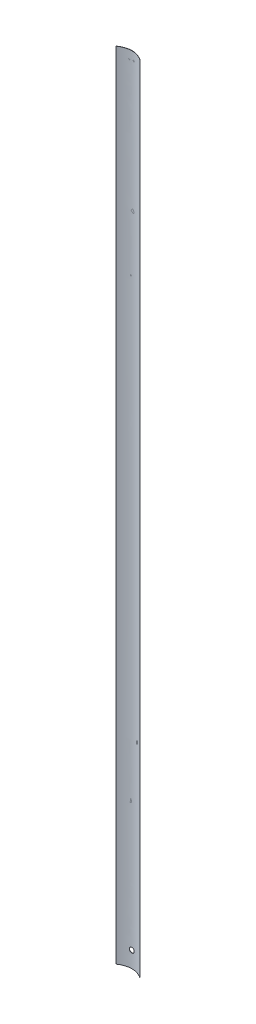
ISO-10303-21;
HEADER;
FILE_DESCRIPTION(('STEP AP214'),'2;1');
FILE_NAME('part.step','',(''),(''),'','','');
FILE_SCHEMA(('AUTOMOTIVE_DESIGN { 1 0 10303 214 1 1 1 1 }'));
ENDSEC;
DATA;
#1=APPLICATION_CONTEXT('core data for automotive mechanical design processes');
#2=APPLICATION_PROTOCOL_DEFINITION('international standard','automotive_design',2000,#1);
#3=PRODUCT_CONTEXT('',#1,'mechanical');
#4=PRODUCT('Part','Part','',(#3));
#5=PRODUCT_RELATED_PRODUCT_CATEGORY('part','',(#4));
#6=PRODUCT_DEFINITION_FORMATION('','',#4);
#7=PRODUCT_DEFINITION_CONTEXT('part definition',#1,'design');
#8=PRODUCT_DEFINITION('design','',#6,#7);
#9=PRODUCT_DEFINITION_SHAPE('','',#8);
#10=(LENGTH_UNIT() NAMED_UNIT(*) SI_UNIT(.MILLI.,.METRE.));
#11=(NAMED_UNIT(*) PLANE_ANGLE_UNIT() SI_UNIT($,.RADIAN.));
#12=(NAMED_UNIT(*) SI_UNIT($,.STERADIAN.) SOLID_ANGLE_UNIT());
#13=UNCERTAINTY_MEASURE_WITH_UNIT(LENGTH_MEASURE(1.E-05),#10,'distance_accuracy_value','');
#14=(GEOMETRIC_REPRESENTATION_CONTEXT(3) GLOBAL_UNCERTAINTY_ASSIGNED_CONTEXT((#13)) GLOBAL_UNIT_ASSIGNED_CONTEXT((#10,
#11,#12)) REPRESENTATION_CONTEXT('',''));
#15=CARTESIAN_POINT('',(0.,0.,0.));
#16=DIRECTION('',(0.,0.,1.));
#17=DIRECTION('',(1.,0.,0.));
#18=AXIS2_PLACEMENT_3D('',#15,#16,#17);
#19=CARTESIAN_POINT('',(7.55,495.,2.55));
#20=CARTESIAN_POINT('',(0.,495.,-2.55));
#21=CARTESIAN_POINT('',(-7.55,495.,2.55));
#22=B_SPLINE_CURVE_WITH_KNOTS('',2,(#19,#20,#21),.UNSPECIFIED.,.F.,.F.,(3,3),(0.,1.),.UNSPECIFIED.);
#23=DIRECTION('',(0.,-1.,0.));
#24=VECTOR('',#23,1.);
#25=SURFACE_OF_LINEAR_EXTRUSION('',#22,#24);
#26=CARTESIAN_POINT('',(7.55,0.,2.55));
#27=CARTESIAN_POINT('',(0.,0.,-2.55));
#28=CARTESIAN_POINT('',(-7.55,0.,2.55));
#29=B_SPLINE_CURVE_WITH_KNOTS('',2,(#26,#27,#28),.UNSPECIFIED.,.F.,.F.,(3,3),(0.,1.),.UNSPECIFIED.);
#30=CARTESIAN_POINT('',(7.55,0.,2.55));
#31=VERTEX_POINT('',#30);
#32=CARTESIAN_POINT('',(-7.55,0.,2.55));
#33=VERTEX_POINT('',#32);
#34=EDGE_CURVE('E130',#31,#33,#29,.T.);
#35=ORIENTED_EDGE('',*,*,#34,.T.);
#36=DIRECTION('',(0.,-1.,0.));
#37=VECTOR('',#36,1.);
#38=CARTESIAN_POINT('',(-7.55,495.,2.55));
#39=LINE('',#38,#37);
#40=CARTESIAN_POINT('',(-7.55,495.,2.55));
#41=VERTEX_POINT('',#40);
#42=EDGE_CURVE('E11',#41,#33,#39,.T.);
#43=ORIENTED_EDGE('',*,*,#42,.F.);
#44=CARTESIAN_POINT('',(7.55,495.,2.55));
#45=VERTEX_POINT('',#44);
#46=EDGE_CURVE('E95',#45,#41,#22,.T.);
#47=ORIENTED_EDGE('',*,*,#46,.F.);
#48=DIRECTION('',(0.,-1.,0.));
#49=VECTOR('',#48,1.);
#50=CARTESIAN_POINT('',(7.55,495.,2.55));
#51=LINE('',#50,#49);
#52=EDGE_CURVE('E105',#45,#31,#51,.T.);
#53=ORIENTED_EDGE('',*,*,#52,.T.);
#54=EDGE_LOOP('',(#35,#43,#47,#53));
#55=FACE_BOUND('',#54,.T.);
#56=CARTESIAN_POINT('',(-1.5,10.,0.100653480110522));
#57=CARTESIAN_POINT('',(-1.49999431285718,10.0838646066992,0.100651792295512));
#58=CARTESIAN_POINT('',(-1.49293338316071,10.1678058005521,0.0996975639981936));
#59=CARTESIAN_POINT('',(-1.47193859508495,10.2918337185694,0.0969210509758726));
#60=CARTESIAN_POINT('',(-1.46319613678544,10.3328919671795,0.0957700049444248));
#61=CARTESIAN_POINT('',(-1.44230116384071,10.4141591924737,0.0930540127045027));
#62=CARTESIAN_POINT('',(-1.43014567901787,10.4543673964895,0.0914887060552472));
#63=CARTESIAN_POINT('',(-1.38872579838233,10.5731063897296,0.0862392860588191));
#64=CARTESIAN_POINT('',(-1.35447729637129,10.6499314432978,0.0819973598487011));
#65=CARTESIAN_POINT('',(-1.27366670264573,10.7967402957515,0.0724976995606779));
#66=CARTESIAN_POINT('',(-1.22710371634552,10.8667235971118,0.0672398916915297));
#67=CARTESIAN_POINT('',(-1.14891722880493,10.9652814172152,0.0590199446646177));
#68=CARTESIAN_POINT('',(-1.12135621548279,10.9971622234563,0.0562142691923894));
#69=CARTESIAN_POINT('',(-1.06368360097659,11.058464445282,0.0505768141488441));
#70=CARTESIAN_POINT('',(-1.03357448605199,11.0878882038241,0.0477450623719421));
#71=CARTESIAN_POINT('',(-0.939660883994427,11.1722221739618,0.0393244827314251));
#72=CARTESIAN_POINT('',(-0.87225173242169,11.2232182370906,0.0338083132396474));
#73=CARTESIAN_POINT('',(-0.729552605881441,11.3133587939503,0.0235815519312006));
#74=CARTESIAN_POINT('',(-0.654233446146776,11.3524571646847,0.0188741252455882));
#75=CARTESIAN_POINT('',(-0.498015267740199,11.4174386640017,0.0108226125790477));
#76=CARTESIAN_POINT('',(-0.417116488322686,11.4433223588311,0.00747846818294182));
#77=CARTESIAN_POINT('',(-0.2525578746935,11.4809786661868,0.00255251178261505));
#78=CARTESIAN_POINT('',(-0.16891740381089,11.4928345864933,0.000960299447560267));
#79=CARTESIAN_POINT('',(-0.000819346726608315,11.5023598037955,-0.000315880879955897));
#80=CARTESIAN_POINT('',(0.0836382023601239,11.500029742182,6.48540231479222E-08));
#81=CARTESIAN_POINT('',(0.250397215140935,11.48131569654,0.00249568094463951));
#82=CARTESIAN_POINT('',(0.332709077696307,11.4650225332826,0.00466330704963182));
#83=CARTESIAN_POINT('',(0.493419855018076,11.4189869997377,0.0106022250034522));
#84=CARTESIAN_POINT('',(0.57181868294679,11.3892443311272,0.0143735524237987));
#85=CARTESIAN_POINT('',(0.722757550610845,11.3170580252887,0.0231126560570173));
#86=CARTESIAN_POINT('',(0.79527869538405,11.2745753417102,0.0280841011924952));
#87=CARTESIAN_POINT('',(0.932196985464252,11.1781431036395,0.0386641920627108));
#88=CARTESIAN_POINT('',(0.99659370504737,11.1241929486436,0.0442728711595785));
#89=CARTESIAN_POINT('',(1.11596568297945,11.0058524165739,0.0555509296080301));
#90=CARTESIAN_POINT('',(1.17086292806391,10.9413833287605,0.0612204396085739));
#91=CARTESIAN_POINT('',(1.26906973077166,10.8041047463486,0.071939000795128));
#92=CARTESIAN_POINT('',(1.31237924946203,10.7312952237286,0.0769880498964577));
#93=CARTESIAN_POINT('',(1.38618506710866,10.5793346364595,0.0858972259978364));
#94=CARTESIAN_POINT('',(1.41667533332309,10.5001806068999,0.0897567929998765));
#95=CARTESIAN_POINT('',(1.46390914915504,10.3378128533395,0.0958430115563227));
#96=CARTESIAN_POINT('',(1.48065344861879,10.2545993510465,0.0980697521811437));
#97=CARTESIAN_POINT('',(1.49981680545721,10.0871571122116,0.100624757071384));
#98=CARTESIAN_POINT('',(1.5023445762183,10.0029410291903,0.100967428307807));
#99=CARTESIAN_POINT('',(1.49329052409646,9.83528645838529,0.0997541679389135));
#100=CARTESIAN_POINT('',(1.48170904539984,9.75184795168305,0.0981982826476947));
#101=CARTESIAN_POINT('',(1.44485629426366,9.58844346765926,0.093374024345279));
#102=CARTESIAN_POINT('',(1.41963768567805,9.50846540174186,0.0901122407516467));
#103=CARTESIAN_POINT('',(1.35628123435542,9.35387289570518,0.0822451198699843));
#104=CARTESIAN_POINT('',(1.31814288536463,9.27925866590412,0.0776397299343716));
#105=CARTESIAN_POINT('',(1.22976671185467,9.13702515683214,0.0675661864530185));
#106=CARTESIAN_POINT('',(1.17945845465518,9.06944999760439,0.062093077007339));
#107=CARTESIAN_POINT('',(1.06826960555365,8.94366335051935,0.0509135248451472));
#108=CARTESIAN_POINT('',(1.00738853669014,8.88545228532407,0.0452070716108955));
#109=CARTESIAN_POINT('',(0.876303853481706,8.77965943625974,0.0341592475910866));
#110=CARTESIAN_POINT('',(0.806041887715506,8.7321496389072,0.0288205077945368));
#111=CARTESIAN_POINT('',(0.65847167757804,8.64960667169099,0.019153177129526));
#112=CARTESIAN_POINT('',(0.581163592612084,8.61457321966124,0.0148245634167295));
#113=CARTESIAN_POINT('',(0.421925924913373,8.55809385219358,0.00768129725174123));
#114=CARTESIAN_POINT('',(0.340010842989711,8.53660764588504,0.00486215927428828));
#115=CARTESIAN_POINT('',(0.173695875742995,8.50770201052955,0.00104048718657105));
#116=CARTESIAN_POINT('',(0.0892961220181265,8.50028183784539,3.78570420477933E-05));
#117=CARTESIAN_POINT('',(-0.0788868133171501,8.49973614514404,-3.54433868339183E-05));
#118=CARTESIAN_POINT('',(-0.162669626043009,8.50649870844328,0.000878760481066006));
#119=CARTESIAN_POINT('',(-0.327886757549394,8.53388063435902,0.00450386476565647));
#120=CARTESIAN_POINT('',(-0.409321078293549,8.55449998538919,0.00721476368004267));
#121=CARTESIAN_POINT('',(-0.567554820884819,8.60900332200392,0.014130182781197));
#122=CARTESIAN_POINT('',(-0.644356382605354,8.64288112850883,0.0183340071083672));
#123=CARTESIAN_POINT('',(-0.754407562727844,8.70284105545711,0.0253992468835358));
#124=CARTESIAN_POINT('',(-0.790239610339065,8.72435694021079,0.0278815001190139));
#125=CARTESIAN_POINT('',(-0.860011758840861,8.77031465432355,0.0330324110184909));
#126=CARTESIAN_POINT('',(-0.89395001225734,8.79475927008634,0.0357012451747164));
#127=CARTESIAN_POINT('',(-0.992968618144759,8.87257675409185,0.0439125539480119));
#128=CARTESIAN_POINT('',(-1.05478391747526,8.93017751012652,0.0496283201585544));
#129=CARTESIAN_POINT('',(-1.16788382971884,9.0549408343958,0.0608724682506423));
#130=CARTESIAN_POINT('',(-1.21916854692725,9.12210330791958,0.0664008519875788));
#131=CARTESIAN_POINT('',(-1.28721561200792,9.22872097494618,0.0740991601405086));
#132=CARTESIAN_POINT('',(-1.30846653961221,9.2653539822084,0.0765725158407135));
#133=CARTESIAN_POINT('',(-1.34778787538476,9.34025995872088,0.0812451514542537));
#134=CARTESIAN_POINT('',(-1.36586109294732,9.37853144179431,0.083444672955314));
#135=CARTESIAN_POINT('',(-1.41510379001963,9.49541474988403,0.089533456263341));
#136=CARTESIAN_POINT('',(-1.44136654006386,9.57620563882682,0.0929211905107013));
#137=CARTESIAN_POINT('',(-1.47369923859358,9.71448535437408,0.0971475067702852));
#138=CARTESIAN_POINT('',(-1.48354597342427,9.7711204485693,0.0984554075553562));
#139=CARTESIAN_POINT('',(-1.49669827226382,9.88515839112116,0.100208968338332));
#140=CARTESIAN_POINT('',(-1.50000389511722,9.94256123256641,0.100654636092975));
#141=CARTESIAN_POINT('',(-1.5,10.,0.100653480110522));
#142=B_SPLINE_CURVE_WITH_KNOTS('',3,(#56,#57,#58,#59,#60,#61,#62,#63,#64,#65,#66,#67,#68,#69,
#70,#71,#72,#73,#74,#75,#76,#77,#78,#79,#80,#81,#82,#83,#84,#85,#86,#87,#88,#89,#90,#91,#92,#93,
#94,#95,#96,#97,#98,#99,#100,#101,#102,#103,#104,#105,#106,#107,#108,#109,#110,#111,#112,#113,
#114,#115,#116,#117,#118,#119,#120,#121,#122,#123,#124,#125,#126,#127,#128,#129,#130,#131,#132,
#133,#134,#135,#136,#137,#138,#139,#140,#141),.UNSPECIFIED.,.T.,.F.,(4,2,2,2,2,2,2,2,2,2,2,2,2,
2,2,2,2,2,2,2,2,2,2,2,2,2,2,2,2,2,2,2,2,2,2,2,2,2,2,2,2,2,4),(0.,0.251349590871805,
0.377210195403728,0.503180671101368,0.754581086509833,1.00599976992017,1.13257625920911,
1.25903063734848,1.51185156364139,1.76564045187468,2.01941846438414,2.2716816586722,
2.52393344746867,2.77455685039654,3.02518581266389,3.27659090724565,3.52800917011137,
3.78140315101228,4.03479798326587,4.28831193004454,4.54181204664942,4.79337099177393,
5.04492380039805,5.2955120288127,5.54611007754178,5.79819468739718,6.05029067226772,
6.30403494960032,6.55777348786595,6.81075377771056,7.06372069272505,7.31469894648499,
7.56567699039003,7.81653820544651,7.94202050411355,8.06762314946584,8.32041322945648,
8.57320080568264,8.70033374057975,8.82735370658073,9.08100572243986,9.25315630113192,
9.42530533113221),.UNSPECIFIED.);
#143=CARTESIAN_POINT('',(-1.5,10.,0.100653480110522));
#144=VERTEX_POINT('',#143);
#145=EDGE_CURVE('E133',#144,#144,#142,.T.);
#146=ORIENTED_EDGE('',*,*,#145,.F.);
#147=EDGE_LOOP('',(#146));
#148=FACE_BOUND('',#147,.T.);
#149=ADVANCED_FACE('F36',(#55,#148),#25,.F.);
#150=CARTESIAN_POINT('',(-7.45,495.,2.55));
#151=CARTESIAN_POINT('',(0.,495.,-2.35));
#152=CARTESIAN_POINT('',(7.45,495.,2.55));
#153=B_SPLINE_CURVE_WITH_KNOTS('',2,(#150,#151,#152),.UNSPECIFIED.,.F.,.F.,(3,3),(0.,1.),.UNSPECIFIED.);
#154=DIRECTION('',(0.,-1.,0.));
#155=VECTOR('',#154,1.);
#156=SURFACE_OF_LINEAR_EXTRUSION('',#153,#155);
#157=CARTESIAN_POINT('',(-7.45,0.,2.55));
#158=CARTESIAN_POINT('',(0.,0.,-2.35));
#159=CARTESIAN_POINT('',(7.45,0.,2.55));
#160=B_SPLINE_CURVE_WITH_KNOTS('',2,(#157,#158,#159),.UNSPECIFIED.,.F.,.F.,(3,3),(0.,1.),.UNSPECIFIED.);
#161=CARTESIAN_POINT('',(-7.45,0.,2.55));
#162=VERTEX_POINT('',#161);
#163=CARTESIAN_POINT('',(7.45,0.,2.55));
#164=VERTEX_POINT('',#163);
#165=EDGE_CURVE('E77',#162,#164,#160,.T.);
#166=ORIENTED_EDGE('',*,*,#165,.T.);
#167=DIRECTION('',(0.,-1.,0.));
#168=VECTOR('',#167,1.);
#169=CARTESIAN_POINT('',(7.45,495.,2.55));
#170=LINE('',#169,#168);
#171=CARTESIAN_POINT('',(7.45,495.,2.55));
#172=VERTEX_POINT('',#171);
#173=EDGE_CURVE('E100',#172,#164,#170,.T.);
#174=ORIENTED_EDGE('',*,*,#173,.F.);
#175=CARTESIAN_POINT('',(-7.45,495.,2.55));
#176=VERTEX_POINT('',#175);
#177=EDGE_CURVE('E93',#176,#172,#153,.T.);
#178=ORIENTED_EDGE('',*,*,#177,.F.);
#179=DIRECTION('',(0.,-1.,0.));
#180=VECTOR('',#179,1.);
#181=CARTESIAN_POINT('',(-7.45,495.,2.55));
#182=LINE('',#181,#180);
#183=EDGE_CURVE('E52',#176,#162,#182,.T.);
#184=ORIENTED_EDGE('',*,*,#183,.T.);
#185=EDGE_LOOP('',(#166,#174,#178,#184));
#186=FACE_BOUND('',#185,.T.);
#187=CARTESIAN_POINT('',(-1.5,9.99999999999998,0.199319850457186));
#188=CARTESIAN_POINT('',(-1.49999430848385,9.91612492163026,0.199318182227654));
#189=CARTESIAN_POINT('',(-1.49293162183111,9.83217296057273,0.198376362523932));
#190=CARTESIAN_POINT('',(-1.47193131908059,9.70812874572493,0.195635928665539));
#191=CARTESIAN_POINT('',(-1.46318650797824,9.66706494479353,0.194499833439166));
#192=CARTESIAN_POINT('',(-1.44228577972542,9.58578661984076,0.191819112214607));
#193=CARTESIAN_POINT('',(-1.43012689060927,9.54557286873332,0.190274130346938));
#194=CARTESIAN_POINT('',(-1.38869498973415,9.42681700663662,0.185092842792503));
#195=CARTESIAN_POINT('',(-1.35443613249866,9.34998082134361,0.180905948855758));
#196=CARTESIAN_POINT('',(-1.27360014927514,9.20315176876105,0.171529597235094));
#197=CARTESIAN_POINT('',(-1.22702214527932,9.13315938972911,0.166340068098665));
#198=CARTESIAN_POINT('',(-1.14881402064102,9.0345956596099,0.158227468412159));
#199=CARTESIAN_POINT('',(-1.12124817493764,9.00271620147693,0.155458738766125));
#200=CARTESIAN_POINT('',(-1.06356585942425,8.94141715985286,0.149895617312838));
#201=CARTESIAN_POINT('',(-1.03345187566473,8.9119952331648,0.14710125283631));
#202=CARTESIAN_POINT('',(-0.939523860548328,8.82766770109494,0.138792026417465));
#203=CARTESIAN_POINT('',(-0.872105321432652,8.77667714547223,0.133349037082875));
#204=CARTESIAN_POINT('',(-0.729396746150109,8.68655497139132,0.123259058286513));
#205=CARTESIAN_POINT('',(-0.654078320898571,8.64746824036849,0.118615109816104));
#206=CARTESIAN_POINT('',(-0.497865558488152,8.58250914254706,0.110672652109047));
#207=CARTESIAN_POINT('',(-0.416971454309432,8.55663622398776,0.107374086695262));
#208=CARTESIAN_POINT('',(-0.252412793567095,8.51899633098807,0.102515411763021));
#209=CARTESIAN_POINT('',(-0.168767083936631,8.50714820021797,0.100945304029303));
#210=CARTESIAN_POINT('',(-0.000660304636202559,8.49763989407351,0.0996882603813845));
#211=CARTESIAN_POINT('',(0.083800728930668,8.49997909332578,0.100001241461173));
#212=CARTESIAN_POINT('',(0.250580012756464,8.51871418145095,0.102466531176089));
#213=CARTESIAN_POINT('',(0.332908394334253,8.53502162850044,0.104607266865084));
#214=CARTESIAN_POINT('',(0.493649835440868,8.58109184585233,0.110471660571919));
#215=CARTESIAN_POINT('',(0.572062810071849,8.61085490777254,0.114195352896398));
#216=CARTESIAN_POINT('',(0.72302026890584,8.68308524735491,0.122823143734848));
#217=CARTESIAN_POINT('',(0.795546316765921,8.72559061702756,0.127730772811626));
#218=CARTESIAN_POINT('',(0.932469595415827,8.82207151731781,0.138174326273404));
#219=CARTESIAN_POINT('',(0.996866411273789,8.87604763304765,0.143710282702093));
#220=CARTESIAN_POINT('',(1.11621982931084,8.99442966367381,0.154840018407949));
#221=CARTESIAN_POINT('',(1.17110042218407,9.05891222891149,0.160433915992555));
#222=CARTESIAN_POINT('',(1.26927146334273,9.19621383285372,0.171008510815198));
#223=CARTESIAN_POINT('',(1.31256187451125,9.26903289825439,0.175989206089461));
#224=CARTESIAN_POINT('',(1.38632713462776,9.42100598883484,0.184776566618405));
#225=CARTESIAN_POINT('',(1.41679620122248,9.50016285321178,0.188582701947364));
#226=CARTESIAN_POINT('',(1.46398812186988,9.66253094000488,0.194583370253541));
#227=CARTESIAN_POINT('',(1.48071170572753,9.74574194692119,0.196777988792244));
#228=CARTESIAN_POINT('',(1.49983758193486,9.91319158130336,0.199294273517368));
#229=CARTESIAN_POINT('',(1.50234577630528,9.99741791255856,0.199629789255558));
#230=CARTESIAN_POINT('',(1.49324953676709,10.1650896882237,0.198427042408363));
#231=CARTESIAN_POINT('',(1.48164543789712,10.2485351511248,0.196888824307119));
#232=CARTESIAN_POINT('',(1.44474267411652,10.4119591419536,0.192122310316789));
#233=CARTESIAN_POINT('',(1.41949522398305,10.4919494349244,0.188900336435753));
#234=CARTESIAN_POINT('',(1.35607558656885,10.6465612921507,0.181130685808158));
#235=CARTESIAN_POINT('',(1.31790290496842,10.7211826509412,0.17658295835967));
#236=CARTESIAN_POINT('',(1.22945986851617,10.8634129233087,0.166637526653661));
#237=CARTESIAN_POINT('',(1.17912082699193,10.9309787866973,0.161235058903363));
#238=CARTESIAN_POINT('',(1.06787073729425,11.0567407383057,0.150201175154446));
#239=CARTESIAN_POINT('',(1.00695922503415,11.1149364149978,0.144569749113841));
#240=CARTESIAN_POINT('',(0.875827519012721,11.2206822084744,0.133669702745093));
#241=CARTESIAN_POINT('',(0.805550572732982,11.2681622479607,0.128403618319683));
#242=CARTESIAN_POINT('',(0.657957326228375,11.3506437069924,0.118869438307119));
#243=CARTESIAN_POINT('',(0.580641181758178,11.3856454025589,0.114601320645644));
#244=CARTESIAN_POINT('',(0.421389494861241,11.4420629605658,0.107559484740668));
#245=CARTESIAN_POINT('',(0.339468105509977,11.4635182089356,0.104781437734228));
#246=CARTESIAN_POINT('',(0.173146971523967,11.4923616571668,0.101018272461007));
#247=CARTESIAN_POINT('',(0.0887473544968993,11.4997505800392,0.100033062042301));
#248=CARTESIAN_POINT('',(-0.0794475434419277,11.5002350776779,0.0999688374988828));
#249=CARTESIAN_POINT('',(-0.163242505171062,11.4934396276245,0.100875290162888));
#250=CARTESIAN_POINT('',(-0.328478615013985,11.465987739276,0.104461268247836));
#251=CARTESIAN_POINT('',(-0.409919764782905,11.4453313107277,0.107140792421977));
#252=CARTESIAN_POINT('',(-0.568163274524982,11.3907493611202,0.113973425389566));
#253=CARTESIAN_POINT('',(-0.644967664472493,11.3568296960587,0.118125883776562));
#254=CARTESIAN_POINT('',(-0.755017374773693,11.2968044190081,0.125103346876348));
#255=CARTESIAN_POINT('',(-0.790847961867614,11.2752663328801,0.127554544257233));
#256=CARTESIAN_POINT('',(-0.860615102892297,11.2292635125099,0.132640574222237));
#257=CARTESIAN_POINT('',(-0.894549807094577,11.2047959908352,0.135275580694476));
#258=CARTESIAN_POINT('',(-0.993541368023903,11.1269189071286,0.143381078690621));
#259=CARTESIAN_POINT('',(-1.05533132469136,11.0692829203666,0.149021890119532));
#260=CARTESIAN_POINT('',(-1.1683740813318,10.944453474304,0.160116625183686));
#261=CARTESIAN_POINT('',(-1.2196269895356,10.8772601131836,0.16557055073804));
#262=CARTESIAN_POINT('',(-1.28761913732595,10.7706050317865,0.173163272769943));
#263=CARTESIAN_POINT('',(-1.30884954421367,10.7339632708604,0.175602238206294));
#264=CARTESIAN_POINT('',(-1.34812924723165,10.659042005775,0.180209337086597));
#265=CARTESIAN_POINT('',(-1.36618135276379,10.6207639855386,0.182377709217753));
#266=CARTESIAN_POINT('',(-1.41536006953213,10.5038647863049,0.188379306510029));
#267=CARTESIAN_POINT('',(-1.44157939724707,10.4230679931154,0.191717169928523));
#268=CARTESIAN_POINT('',(-1.47381308396563,10.2849014058217,0.195875208098828));
#269=CARTESIAN_POINT('',(-1.48361725642184,10.2283857558304,0.19716025463535));
#270=CARTESIAN_POINT('',(-1.49671263080528,10.1145920325207,0.198883142116427));
#271=CARTESIAN_POINT('',(-1.50000388915716,10.057313965812,0.199320990400685));
#272=CARTESIAN_POINT('',(-1.5,9.99999999999998,0.199319850457186));
#273=B_SPLINE_CURVE_WITH_KNOTS('',3,(#187,#188,#189,#190,#191,#192,#193,#194,#195,#196,#197,
#198,#199,#200,#201,#202,#203,#204,#205,#206,#207,#208,#209,#210,#211,#212,#213,#214,#215,#216,
#217,#218,#219,#220,#221,#222,#223,#224,#225,#226,#227,#228,#229,#230,#231,#232,#233,#234,#235,
#236,#237,#238,#239,#240,#241,#242,#243,#244,#245,#246,#247,#248,#249,#250,#251,#252,#253,#254,
#255,#256,#257,#258,#259,#260,#261,#262,#263,#264,#265,#266,#267,#268,#269,#270,#271,#272),
.UNSPECIFIED.,.T.,.F.,(4,2,2,2,2,2,2,2,2,2,2,2,2,2,2,2,2,2,2,2,2,2,2,2,2,2,2,2,2,2,2,2,2,2,2,2,
2,2,2,2,2,2,4),(0.,0.251381497447403,0.377258655139006,0.503245730826592,0.754680603653653,
1.0061334015284,1.13270896176218,1.25916242382021,1.51198135983375,1.76574215728377,
2.01949235774049,2.27176690635243,2.52403033485674,2.77470823169597,3.02539156163079,
3.27683188977095,3.52828504673126,3.78166237528021,4.03504051524636,4.28853280515292,
4.54201163522741,4.79359958743874,5.04518156684036,5.29582564567676,5.54647931136714,
5.79858255968441,6.05069687706548,6.30441503000736,6.55812757035145,6.81109900965767,
7.06405744584711,7.31507961749472,7.5661016126267,7.81701290118801,7.94252011348238,
8.06814771264101,8.32093884748943,8.57372738567528,8.70084624466441,8.82785216886207,
9.08147529910446,9.25325213261747,9.42502747793477),.UNSPECIFIED.);
#274=CARTESIAN_POINT('',(-1.5,9.99999999999998,0.199319850457186));
#275=VERTEX_POINT('',#274);
#276=EDGE_CURVE('E41',#275,#275,#273,.T.);
#277=ORIENTED_EDGE('',*,*,#276,.F.);
#278=EDGE_LOOP('',(#277));
#279=FACE_BOUND('',#278,.T.);
#280=ADVANCED_FACE('F102',(#186,#279),#156,.F.);
#281=CARTESIAN_POINT('',(-7.45,495.,2.55));
#282=DIRECTION('',(0.,0.,-1.));
#283=DIRECTION('',(-1.,0.,0.));
#284=AXIS2_PLACEMENT_3D('',#281,#282,#283);
#285=PLANE('',#284);
#286=DIRECTION('',(1.,0.,0.));
#287=VECTOR('',#286,1.);
#288=CARTESIAN_POINT('',(-7.45,0.,2.55));
#289=LINE('',#288,#287);
#290=EDGE_CURVE('E99',#33,#162,#289,.T.);
#291=ORIENTED_EDGE('',*,*,#290,.T.);
#292=ORIENTED_EDGE('',*,*,#183,.F.);
#293=DIRECTION('',(1.,0.,0.));
#294=VECTOR('',#293,1.);
#295=CARTESIAN_POINT('',(-7.45,495.,2.55));
#296=LINE('',#295,#294);
#297=EDGE_CURVE('E90',#41,#176,#296,.T.);
#298=ORIENTED_EDGE('',*,*,#297,.F.);
#299=ORIENTED_EDGE('',*,*,#42,.T.);
#300=EDGE_LOOP('',(#291,#292,#298,#299));
#301=FACE_BOUND('',#300,.T.);
#302=ADVANCED_FACE('F98',(#301),#285,.F.);
#303=CARTESIAN_POINT('',(7.55,495.,2.55));
#304=DIRECTION('',(0.,0.,-1.));
#305=DIRECTION('',(-1.,0.,0.));
#306=AXIS2_PLACEMENT_3D('',#303,#304,#305);
#307=PLANE('',#306);
#308=DIRECTION('',(1.,0.,0.));
#309=VECTOR('',#308,1.);
#310=CARTESIAN_POINT('',(7.55,0.,2.55));
#311=LINE('',#310,#309);
#312=EDGE_CURVE('E83',#164,#31,#311,.T.);
#313=ORIENTED_EDGE('',*,*,#312,.T.);
#314=ORIENTED_EDGE('',*,*,#52,.F.);
#315=DIRECTION('',(1.,0.,0.));
#316=VECTOR('',#315,1.);
#317=CARTESIAN_POINT('',(7.55,495.,2.55));
#318=LINE('',#317,#316);
#319=EDGE_CURVE('E60',#172,#45,#318,.T.);
#320=ORIENTED_EDGE('',*,*,#319,.F.);
#321=ORIENTED_EDGE('',*,*,#173,.T.);
#322=EDGE_LOOP('',(#313,#314,#320,#321));
#323=FACE_BOUND('',#322,.T.);
#324=ADVANCED_FACE('F117',(#323),#307,.F.);
#325=CARTESIAN_POINT('',(0.,495.,0.));
#326=DIRECTION('',(0.,-1.,0.));
#327=DIRECTION('',(0.,0.,-1.));
#328=AXIS2_PLACEMENT_3D('',#325,#326,#327);
#329=PLANE('',#328);
#330=ORIENTED_EDGE('',*,*,#46,.T.);
#331=ORIENTED_EDGE('',*,*,#297,.T.);
#332=ORIENTED_EDGE('',*,*,#177,.T.);
#333=ORIENTED_EDGE('',*,*,#319,.T.);
#334=EDGE_LOOP('',(#330,#331,#332,#333));
#335=FACE_BOUND('',#334,.T.);
#336=ADVANCED_FACE('F91',(#335),#329,.F.);
#337=CARTESIAN_POINT('',(0.,0.,0.));
#338=DIRECTION('',(0.,-1.,0.));
#339=DIRECTION('',(0.,0.,-1.));
#340=AXIS2_PLACEMENT_3D('',#337,#338,#339);
#341=PLANE('',#340);
#342=ORIENTED_EDGE('',*,*,#34,.F.);
#343=ORIENTED_EDGE('',*,*,#312,.F.);
#344=ORIENTED_EDGE('',*,*,#165,.F.);
#345=ORIENTED_EDGE('',*,*,#290,.F.);
#346=EDGE_LOOP('',(#342,#343,#344,#345));
#347=FACE_BOUND('',#346,.T.);
#348=ADVANCED_FACE('F147',(#347),#341,.T.);
#349=CARTESIAN_POINT('',(0.,10.,2.55));
#350=DIRECTION('',(0.,0.,-1.));
#351=DIRECTION('',(-1.,0.,0.));
#352=AXIS2_PLACEMENT_3D('',#349,#350,#351);
#353=CYLINDRICAL_SURFACE('',#352,1.5);
#354=ORIENTED_EDGE('',*,*,#276,.T.);
#355=EDGE_LOOP('',(#354));
#356=FACE_BOUND('',#355,.T.);
#357=ORIENTED_EDGE('',*,*,#145,.T.);
#358=EDGE_LOOP('',(#357));
#359=FACE_BOUND('',#358,.T.);
#360=ADVANCED_FACE('F143',(#356,#359),#353,.F.);
#361=CLOSED_SHELL('',(#149,#280,#302,#324,#336,#348,#360));
#362=MANIFOLD_SOLID_BREP('B2',#361);
#363=ADVANCED_BREP_SHAPE_REPRESENTATION('',(#18,#362),#14);
#364=SHAPE_DEFINITION_REPRESENTATION(#9,#363);
ENDSEC;
END-ISO-10303-21;
